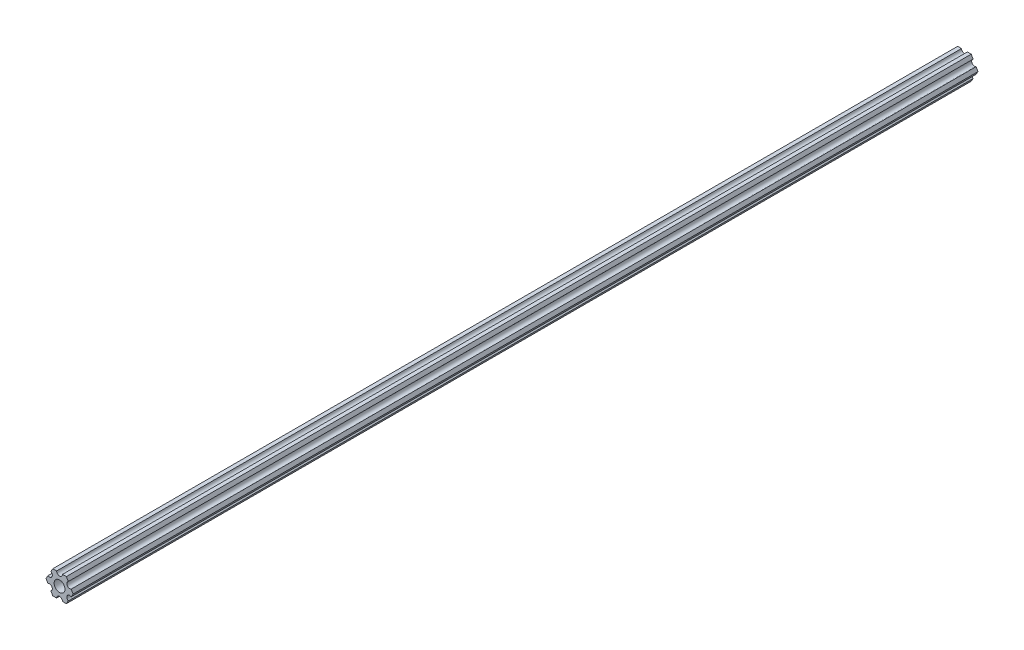
ISO-10303-21;
HEADER;
FILE_DESCRIPTION(('STEP AP214'),'2;1');
FILE_NAME('part.step','',(''),(''),'','','');
FILE_SCHEMA(('AUTOMOTIVE_DESIGN { 1 0 10303 214 1 1 1 1 }'));
ENDSEC;
DATA;
#1=APPLICATION_CONTEXT('core data for automotive mechanical design processes');
#2=APPLICATION_PROTOCOL_DEFINITION('international standard','automotive_design',2000,#1);
#3=PRODUCT_CONTEXT('',#1,'mechanical');
#4=PRODUCT('Part','Part','',(#3));
#5=PRODUCT_RELATED_PRODUCT_CATEGORY('part','',(#4));
#6=PRODUCT_DEFINITION_FORMATION('','',#4);
#7=PRODUCT_DEFINITION_CONTEXT('part definition',#1,'design');
#8=PRODUCT_DEFINITION('design','',#6,#7);
#9=PRODUCT_DEFINITION_SHAPE('','',#8);
#10=(LENGTH_UNIT() NAMED_UNIT(*) SI_UNIT(.MILLI.,.METRE.));
#11=(NAMED_UNIT(*) PLANE_ANGLE_UNIT() SI_UNIT($,.RADIAN.));
#12=(NAMED_UNIT(*) SI_UNIT($,.STERADIAN.) SOLID_ANGLE_UNIT());
#13=UNCERTAINTY_MEASURE_WITH_UNIT(LENGTH_MEASURE(1.E-05),#10,'distance_accuracy_value','');
#14=(GEOMETRIC_REPRESENTATION_CONTEXT(3) GLOBAL_UNCERTAINTY_ASSIGNED_CONTEXT((#13)) GLOBAL_UNIT_ASSIGNED_CONTEXT((#10,
#11,#12)) REPRESENTATION_CONTEXT('',''));
#15=CARTESIAN_POINT('',(0.,0.,0.));
#16=DIRECTION('',(0.,0.,1.));
#17=DIRECTION('',(1.,0.,0.));
#18=AXIS2_PLACEMENT_3D('',#15,#16,#17);
#19=CARTESIAN_POINT('',(5.49926112168156,3.17500033315933,488.95));
#20=DIRECTION('',(0.,0.,1.));
#21=DIRECTION('',(1.,0.,0.));
#22=AXIS2_PLACEMENT_3D('',#19,#20,#21);
#23=PLANE('',#22);
#24=DIRECTION('',(0.499999947533953,0.866025434075723,0.));
#25=VECTOR('',#24,1.);
#26=CARTESIAN_POINT('',(6.29301142309098,-1.80018429024546,488.95));
#27=LINE('',#26,#25);
#28=CARTESIAN_POINT('',(6.29301142309098,-1.80018429024546,488.95));
#29=VERTEX_POINT('',#28);
#30=CARTESIAN_POINT('',(7.33234841870826,4.44212519169686E-07,488.95));
#31=VERTEX_POINT('',#30);
#32=EDGE_CURVE('E227',#29,#31,#27,.T.);
#33=ORIENTED_EDGE('',*,*,#32,.T.);
#34=DIRECTION('',(-0.500000052466056,0.866025373493145,0.));
#35=VECTOR('',#34,1.);
#36=CARTESIAN_POINT('',(7.33234841870826,4.44212519169686E-07,488.95));
#37=LINE('',#36,#35);
#38=CARTESIAN_POINT('',(6.29301120497139,1.80018505273894,488.95));
#39=VERTEX_POINT('',#38);
#40=EDGE_CURVE('E125',#31,#39,#37,.T.);
#41=ORIENTED_EDGE('',*,*,#40,.T.);
#42=CARTESIAN_POINT('',(5.49926112168156,3.17500033315933,488.95));
#43=DIRECTION('',(0.,0.,-1.));
#44=DIRECTION('',(1.,0.,0.));
#45=AXIS2_PLACEMENT_3D('',#42,#43,#44);
#46=CIRCLE('',#45,1.5875);
#47=CARTESIAN_POINT('',(4.70551103839172,4.54981561357972,488.95));
#48=VERTEX_POINT('',#47);
#49=EDGE_CURVE('E272',#39,#48,#46,.T.);
#50=ORIENTED_EDGE('',*,*,#49,.T.);
#51=DIRECTION('',(-0.500000052466046,0.866025373493151,0.));
#52=VECTOR('',#51,1.);
#53=CARTESIAN_POINT('',(4.70551103839172,4.54981561357972,488.95));
#54=LINE('',#53,#52);
#55=CARTESIAN_POINT('',(3.66617382465481,6.35000022210627,488.95));
#56=VERTEX_POINT('',#55);
#57=EDGE_CURVE('E291',#48,#56,#54,.T.);
#58=ORIENTED_EDGE('',*,*,#57,.T.);
#59=DIRECTION('',(-0.999999999999998,-6.05825850611185E-08,0.));
#60=VECTOR('',#59,1.);
#61=CARTESIAN_POINT('',(3.66617382465481,6.35000022210627,488.95));
#62=LINE('',#61,#60);
#63=CARTESIAN_POINT('',(1.58749961530074,6.35000009617482,488.95));
#64=VERTEX_POINT('',#63);
#65=EDGE_CURVE('E288',#56,#64,#62,.T.);
#66=ORIENTED_EDGE('',*,*,#65,.T.);
#67=CARTESIAN_POINT('',(-3.84699260060323E-07,6.35,488.95));
#68=DIRECTION('',(0.,0.,-1.));
#69=DIRECTION('',(1.,0.,0.));
#70=AXIS2_PLACEMENT_3D('',#67,#68,#69);
#71=CIRCLE('',#70,1.5875);
#72=CARTESIAN_POINT('',(-1.58750038469926,6.34999990382518,488.95));
#73=VERTEX_POINT('',#72);
#74=EDGE_CURVE('E290',#64,#73,#71,.T.);
#75=ORIENTED_EDGE('',*,*,#74,.T.);
#76=DIRECTION('',(-0.999999999999998,-6.05825963273174E-08,0.));
#77=VECTOR('',#76,1.);
#78=CARTESIAN_POINT('',(-1.58750038469926,6.34999990382518,488.95));
#79=LINE('',#78,#77);
#80=CARTESIAN_POINT('',(-3.66617459405349,6.3499997778937,488.95));
#81=VERTEX_POINT('',#80);
#82=EDGE_CURVE('E293',#73,#81,#79,.T.);
#83=ORIENTED_EDGE('',*,*,#82,.T.);
#84=DIRECTION('',(-0.499999947533942,-0.866025434075729,0.));
#85=VECTOR('',#84,1.);
#86=CARTESIAN_POINT('',(-3.66617459405349,6.3499997778937,488.95));
#87=LINE('',#86,#85);
#88=CARTESIAN_POINT('',(-4.70551158967065,4.54981504343587,488.95));
#89=VERTEX_POINT('',#88);
#90=EDGE_CURVE('E299',#81,#89,#87,.T.);
#91=ORIENTED_EDGE('',*,*,#90,.T.);
#92=CARTESIAN_POINT('',(-5.49926150638082,3.17499966684067,488.95));
#93=DIRECTION('',(0.,0.,-1.));
#94=DIRECTION('',(1.,0.,0.));
#95=AXIS2_PLACEMENT_3D('',#92,#93,#94);
#96=CIRCLE('',#95,1.5875);
#97=CARTESIAN_POINT('',(-6.29301142309098,1.80018429024547,488.95));
#98=VERTEX_POINT('',#97);
#99=EDGE_CURVE('E301',#89,#98,#96,.T.);
#100=ORIENTED_EDGE('',*,*,#99,.T.);
#101=DIRECTION('',(-0.499999947533951,-0.866025434075724,0.));
#102=VECTOR('',#101,1.);
#103=CARTESIAN_POINT('',(-6.29301142309098,1.80018429024547,488.95));
#104=LINE('',#103,#102);
#105=CARTESIAN_POINT('',(-7.33234841870826,-4.44212523790841E-07,488.95));
#106=VERTEX_POINT('',#105);
#107=EDGE_CURVE('E303',#98,#106,#104,.T.);
#108=ORIENTED_EDGE('',*,*,#107,.T.);
#109=DIRECTION('',(0.500000052466045,-0.866025373493151,0.));
#110=VECTOR('',#109,1.);
#111=CARTESIAN_POINT('',(-7.33234841870826,-4.44212523790841E-07,488.95));
#112=LINE('',#111,#110);
#113=CARTESIAN_POINT('',(-6.29301120497141,-1.80018505273897,488.95));
#114=VERTEX_POINT('',#113);
#115=EDGE_CURVE('E305',#106,#114,#112,.T.);
#116=ORIENTED_EDGE('',*,*,#115,.T.);
#117=CARTESIAN_POINT('',(-5.49926112168156,-3.17500033315934,488.95));
#118=DIRECTION('',(0.,0.,-1.));
#119=DIRECTION('',(1.,0.,0.));
#120=AXIS2_PLACEMENT_3D('',#117,#118,#119);
#121=CIRCLE('',#120,1.5875);
#122=CARTESIAN_POINT('',(-4.70551103839172,-4.54981561357972,488.95));
#123=VERTEX_POINT('',#122);
#124=EDGE_CURVE('E307',#114,#123,#121,.T.);
#125=ORIENTED_EDGE('',*,*,#124,.T.);
#126=DIRECTION('',(0.500000052466045,-0.866025373493151,0.));
#127=VECTOR('',#126,1.);
#128=CARTESIAN_POINT('',(-4.70551103839172,-4.54981561357972,488.95));
#129=LINE('',#128,#127);
#130=CARTESIAN_POINT('',(-3.66617382465481,-6.35000022210628,488.95));
#131=VERTEX_POINT('',#130);
#132=EDGE_CURVE('E309',#123,#131,#129,.T.);
#133=ORIENTED_EDGE('',*,*,#132,.T.);
#134=DIRECTION('',(0.999999999999998,6.05825854783851E-08,0.));
#135=VECTOR('',#134,1.);
#136=CARTESIAN_POINT('',(-3.66617382465481,-6.35000022210628,488.95));
#137=LINE('',#136,#135);
#138=CARTESIAN_POINT('',(-1.58749961530074,-6.35000009617482,488.95));
#139=VERTEX_POINT('',#138);
#140=EDGE_CURVE('E311',#131,#139,#137,.T.);
#141=ORIENTED_EDGE('',*,*,#140,.T.);
#142=CARTESIAN_POINT('',(3.8469926204343E-07,-6.35,488.95));
#143=DIRECTION('',(0.,0.,-1.));
#144=DIRECTION('',(1.,0.,0.));
#145=AXIS2_PLACEMENT_3D('',#142,#143,#144);
#146=CIRCLE('',#145,1.5875);
#147=CARTESIAN_POINT('',(1.58750038469926,-6.34999990382518,488.95));
#148=VERTEX_POINT('',#147);
#149=EDGE_CURVE('E174',#139,#148,#146,.T.);
#150=ORIENTED_EDGE('',*,*,#149,.T.);
#151=DIRECTION('',(0.999999999999998,6.05825721258438E-08,0.));
#152=VECTOR('',#151,1.);
#153=CARTESIAN_POINT('',(1.58750038469926,-6.34999990382518,488.95));
#154=LINE('',#153,#152);
#155=CARTESIAN_POINT('',(3.66617459405346,-6.34999977789375,488.95));
#156=VERTEX_POINT('',#155);
#157=EDGE_CURVE('E168',#148,#156,#154,.T.);
#158=ORIENTED_EDGE('',*,*,#157,.T.);
#159=DIRECTION('',(0.499999947533941,0.86602543407573,0.));
#160=VECTOR('',#159,1.);
#161=CARTESIAN_POINT('',(3.66617459405346,-6.34999977789375,488.95));
#162=LINE('',#161,#160);
#163=CARTESIAN_POINT('',(4.70551158967065,-4.54981504343587,488.95));
#164=VERTEX_POINT('',#163);
#165=EDGE_CURVE('E172',#156,#164,#162,.T.);
#166=ORIENTED_EDGE('',*,*,#165,.T.);
#167=CARTESIAN_POINT('',(5.49926150638082,-3.17499966684067,488.95));
#168=DIRECTION('',(0.,0.,-1.));
#169=DIRECTION('',(1.,0.,0.));
#170=AXIS2_PLACEMENT_3D('',#167,#168,#169);
#171=CIRCLE('',#170,1.58750000000001);
#172=EDGE_CURVE('E52',#164,#29,#171,.T.);
#173=ORIENTED_EDGE('',*,*,#172,.T.);
#174=EDGE_LOOP('',(#33,#41,#50,#58,#66,#75,#83,#91,#100,#108,#116,#125,#133,#141,#150,#158,#166,#173));
#175=FACE_BOUND('',#174,.T.);
#176=CARTESIAN_POINT('',(0.,0.,488.95));
#177=DIRECTION('',(0.,0.,1.));
#178=DIRECTION('',(1.,0.,0.));
#179=AXIS2_PLACEMENT_3D('',#176,#177,#178);
#180=CIRCLE('',#179,2.9337);
#181=CARTESIAN_POINT('',(2.9337,0.,488.95));
#182=VERTEX_POINT('',#181);
#183=EDGE_CURVE('E196',#182,#182,#180,.T.);
#184=ORIENTED_EDGE('',*,*,#183,.F.);
#185=EDGE_LOOP('',(#184));
#186=FACE_BOUND('',#185,.T.);
#187=ADVANCED_FACE('F35',(#175,#186),#23,.T.);
#188=CARTESIAN_POINT('',(5.49926112168156,3.17500033315933,0.));
#189=DIRECTION('',(0.,0.,1.));
#190=DIRECTION('',(1.,0.,0.));
#191=AXIS2_PLACEMENT_3D('',#188,#189,#190);
#192=PLANE('',#191);
#193=DIRECTION('',(0.499999947533953,0.866025434075723,0.));
#194=VECTOR('',#193,1.);
#195=CARTESIAN_POINT('',(6.29301142309098,-1.80018429024546,0.));
#196=LINE('',#195,#194);
#197=CARTESIAN_POINT('',(6.29301142309098,-1.80018429024546,0.));
#198=VERTEX_POINT('',#197);
#199=CARTESIAN_POINT('',(7.33234841870826,4.44212519169686E-07,0.));
#200=VERTEX_POINT('',#199);
#201=EDGE_CURVE('E192',#198,#200,#196,.T.);
#202=ORIENTED_EDGE('',*,*,#201,.F.);
#203=CARTESIAN_POINT('',(5.49926150638082,-3.17499966684067,0.));
#204=DIRECTION('',(0.,0.,-1.));
#205=DIRECTION('',(1.,0.,0.));
#206=AXIS2_PLACEMENT_3D('',#203,#204,#205);
#207=CIRCLE('',#206,1.58750000000001);
#208=CARTESIAN_POINT('',(4.70551158967065,-4.54981504343587,0.));
#209=VERTEX_POINT('',#208);
#210=EDGE_CURVE('E117',#209,#198,#207,.T.);
#211=ORIENTED_EDGE('',*,*,#210,.F.);
#212=DIRECTION('',(0.499999947533941,0.86602543407573,0.));
#213=VECTOR('',#212,1.);
#214=CARTESIAN_POINT('',(3.66617459405346,-6.34999977789375,0.));
#215=LINE('',#214,#213);
#216=CARTESIAN_POINT('',(3.66617459405346,-6.34999977789375,0.));
#217=VERTEX_POINT('',#216);
#218=EDGE_CURVE('E111',#217,#209,#215,.T.);
#219=ORIENTED_EDGE('',*,*,#218,.F.);
#220=DIRECTION('',(0.999999999999998,6.05825721258438E-08,0.));
#221=VECTOR('',#220,1.);
#222=CARTESIAN_POINT('',(1.58750038469926,-6.34999990382518,0.));
#223=LINE('',#222,#221);
#224=CARTESIAN_POINT('',(1.58750038469926,-6.34999990382518,0.));
#225=VERTEX_POINT('',#224);
#226=EDGE_CURVE('E182',#225,#217,#223,.T.);
#227=ORIENTED_EDGE('',*,*,#226,.F.);
#228=CARTESIAN_POINT('',(3.8469926204343E-07,-6.35,0.));
#229=DIRECTION('',(0.,0.,-1.));
#230=DIRECTION('',(1.,0.,0.));
#231=AXIS2_PLACEMENT_3D('',#228,#229,#230);
#232=CIRCLE('',#231,1.5875);
#233=CARTESIAN_POINT('',(-1.58749961530074,-6.35000009617482,0.));
#234=VERTEX_POINT('',#233);
#235=EDGE_CURVE('E222',#234,#225,#232,.T.);
#236=ORIENTED_EDGE('',*,*,#235,.F.);
#237=DIRECTION('',(0.999999999999998,6.05825854783851E-08,0.));
#238=VECTOR('',#237,1.);
#239=CARTESIAN_POINT('',(-3.66617382465481,-6.35000022210628,0.));
#240=LINE('',#239,#238);
#241=CARTESIAN_POINT('',(-3.66617382465481,-6.35000022210628,0.));
#242=VERTEX_POINT('',#241);
#243=EDGE_CURVE('E220',#242,#234,#240,.T.);
#244=ORIENTED_EDGE('',*,*,#243,.F.);
#245=DIRECTION('',(0.500000052466045,-0.866025373493151,0.));
#246=VECTOR('',#245,1.);
#247=CARTESIAN_POINT('',(-4.70551103839172,-4.54981561357972,0.));
#248=LINE('',#247,#246);
#249=CARTESIAN_POINT('',(-4.70551103839172,-4.54981561357972,0.));
#250=VERTEX_POINT('',#249);
#251=EDGE_CURVE('E218',#250,#242,#248,.T.);
#252=ORIENTED_EDGE('',*,*,#251,.F.);
#253=CARTESIAN_POINT('',(-5.49926112168156,-3.17500033315934,0.));
#254=DIRECTION('',(0.,0.,-1.));
#255=DIRECTION('',(1.,0.,0.));
#256=AXIS2_PLACEMENT_3D('',#253,#254,#255);
#257=CIRCLE('',#256,1.5875);
#258=CARTESIAN_POINT('',(-6.29301120497141,-1.80018505273897,0.));
#259=VERTEX_POINT('',#258);
#260=EDGE_CURVE('E216',#259,#250,#257,.T.);
#261=ORIENTED_EDGE('',*,*,#260,.F.);
#262=DIRECTION('',(0.500000052466045,-0.866025373493151,0.));
#263=VECTOR('',#262,1.);
#264=CARTESIAN_POINT('',(-7.33234841870826,-4.44212523790841E-07,0.));
#265=LINE('',#264,#263);
#266=CARTESIAN_POINT('',(-7.33234841870826,-4.44212523790841E-07,0.));
#267=VERTEX_POINT('',#266);
#268=EDGE_CURVE('E214',#267,#259,#265,.T.);
#269=ORIENTED_EDGE('',*,*,#268,.F.);
#270=DIRECTION('',(-0.499999947533951,-0.866025434075724,0.));
#271=VECTOR('',#270,1.);
#272=CARTESIAN_POINT('',(-6.29301142309098,1.80018429024547,0.));
#273=LINE('',#272,#271);
#274=CARTESIAN_POINT('',(-6.29301142309098,1.80018429024547,0.));
#275=VERTEX_POINT('',#274);
#276=EDGE_CURVE('E212',#275,#267,#273,.T.);
#277=ORIENTED_EDGE('',*,*,#276,.F.);
#278=CARTESIAN_POINT('',(-5.49926150638082,3.17499966684067,0.));
#279=DIRECTION('',(0.,0.,-1.));
#280=DIRECTION('',(1.,0.,0.));
#281=AXIS2_PLACEMENT_3D('',#278,#279,#280);
#282=CIRCLE('',#281,1.5875);
#283=CARTESIAN_POINT('',(-4.70551158967065,4.54981504343587,0.));
#284=VERTEX_POINT('',#283);
#285=EDGE_CURVE('E210',#284,#275,#282,.T.);
#286=ORIENTED_EDGE('',*,*,#285,.F.);
#287=DIRECTION('',(-0.499999947533942,-0.866025434075729,0.));
#288=VECTOR('',#287,1.);
#289=CARTESIAN_POINT('',(-3.66617459405349,6.3499997778937,0.));
#290=LINE('',#289,#288);
#291=CARTESIAN_POINT('',(-3.66617459405349,6.3499997778937,0.));
#292=VERTEX_POINT('',#291);
#293=EDGE_CURVE('E208',#292,#284,#290,.T.);
#294=ORIENTED_EDGE('',*,*,#293,.F.);
#295=DIRECTION('',(-0.999999999999998,-6.05825963273174E-08,0.));
#296=VECTOR('',#295,1.);
#297=CARTESIAN_POINT('',(-1.58750038469926,6.34999990382518,0.));
#298=LINE('',#297,#296);
#299=CARTESIAN_POINT('',(-1.58750038469926,6.34999990382518,0.));
#300=VERTEX_POINT('',#299);
#301=EDGE_CURVE('E206',#300,#292,#298,.T.);
#302=ORIENTED_EDGE('',*,*,#301,.F.);
#303=CARTESIAN_POINT('',(-3.84699260060323E-07,6.35,0.));
#304=DIRECTION('',(0.,0.,-1.));
#305=DIRECTION('',(1.,0.,0.));
#306=AXIS2_PLACEMENT_3D('',#303,#304,#305);
#307=CIRCLE('',#306,1.5875);
#308=CARTESIAN_POINT('',(1.58749961530074,6.35000009617482,0.));
#309=VERTEX_POINT('',#308);
#310=EDGE_CURVE('E204',#309,#300,#307,.T.);
#311=ORIENTED_EDGE('',*,*,#310,.F.);
#312=DIRECTION('',(-0.999999999999998,-6.05825850611185E-08,0.));
#313=VECTOR('',#312,1.);
#314=CARTESIAN_POINT('',(3.66617382465481,6.35000022210627,0.));
#315=LINE('',#314,#313);
#316=CARTESIAN_POINT('',(3.66617382465481,6.35000022210627,0.));
#317=VERTEX_POINT('',#316);
#318=EDGE_CURVE('E202',#317,#309,#315,.T.);
#319=ORIENTED_EDGE('',*,*,#318,.F.);
#320=DIRECTION('',(-0.500000052466046,0.866025373493151,0.));
#321=VECTOR('',#320,1.);
#322=CARTESIAN_POINT('',(4.70551103839172,4.54981561357972,0.));
#323=LINE('',#322,#321);
#324=CARTESIAN_POINT('',(4.70551103839172,4.54981561357972,0.));
#325=VERTEX_POINT('',#324);
#326=EDGE_CURVE('E200',#325,#317,#323,.T.);
#327=ORIENTED_EDGE('',*,*,#326,.F.);
#328=CARTESIAN_POINT('',(5.49926112168156,3.17500033315933,0.));
#329=DIRECTION('',(0.,0.,-1.));
#330=DIRECTION('',(1.,0.,0.));
#331=AXIS2_PLACEMENT_3D('',#328,#329,#330);
#332=CIRCLE('',#331,1.5875);
#333=CARTESIAN_POINT('',(6.29301120497139,1.80018505273894,0.));
#334=VERTEX_POINT('',#333);
#335=EDGE_CURVE('E198',#334,#325,#332,.T.);
#336=ORIENTED_EDGE('',*,*,#335,.F.);
#337=DIRECTION('',(-0.500000052466056,0.866025373493145,0.));
#338=VECTOR('',#337,1.);
#339=CARTESIAN_POINT('',(7.33234841870826,4.44212519169686E-07,0.));
#340=LINE('',#339,#338);
#341=EDGE_CURVE('E195',#200,#334,#340,.T.);
#342=ORIENTED_EDGE('',*,*,#341,.F.);
#343=EDGE_LOOP('',(#202,#211,#219,#227,#236,#244,#252,#261,#269,#277,#286,#294,#302,#311,#319,
#327,#336,#342));
#344=FACE_BOUND('',#343,.T.);
#345=CARTESIAN_POINT('',(0.,0.,0.));
#346=DIRECTION('',(0.,0.,1.));
#347=DIRECTION('',(1.,0.,0.));
#348=AXIS2_PLACEMENT_3D('',#345,#346,#347);
#349=CIRCLE('',#348,2.9337);
#350=CARTESIAN_POINT('',(2.9337,0.,0.));
#351=VERTEX_POINT('',#350);
#352=EDGE_CURVE('E536',#351,#351,#349,.T.);
#353=ORIENTED_EDGE('',*,*,#352,.T.);
#354=EDGE_LOOP('',(#353));
#355=FACE_BOUND('',#354,.T.);
#356=ADVANCED_FACE('F276',(#344,#355),#192,.F.);
#357=CARTESIAN_POINT('',(6.29301142309098,-1.80018429024546,488.95));
#358=DIRECTION('',(-0.866025434075723,0.499999947533953,0.));
#359=DIRECTION('',(-0.499999947533953,-0.866025434075723,0.));
#360=AXIS2_PLACEMENT_3D('',#357,#358,#359);
#361=PLANE('',#360);
#362=ORIENTED_EDGE('',*,*,#201,.T.);
#363=DIRECTION('',(0.,0.,-1.));
#364=VECTOR('',#363,1.);
#365=CARTESIAN_POINT('',(7.33234841870826,4.44212519169686E-07,488.95));
#366=LINE('',#365,#364);
#367=EDGE_CURVE('E11',#31,#200,#366,.T.);
#368=ORIENTED_EDGE('',*,*,#367,.F.);
#369=ORIENTED_EDGE('',*,*,#32,.F.);
#370=DIRECTION('',(0.,0.,-1.));
#371=VECTOR('',#370,1.);
#372=CARTESIAN_POINT('',(6.29301142309098,-1.80018429024546,488.95));
#373=LINE('',#372,#371);
#374=EDGE_CURVE('E188',#29,#198,#373,.T.);
#375=ORIENTED_EDGE('',*,*,#374,.T.);
#376=EDGE_LOOP('',(#362,#368,#369,#375));
#377=FACE_BOUND('',#376,.T.);
#378=ADVANCED_FACE('F37',(#377),#361,.F.);
#379=CARTESIAN_POINT('',(7.33234841870826,4.44212519169686E-07,488.95));
#380=DIRECTION('',(-0.866025373493145,-0.500000052466057,0.));
#381=DIRECTION('',(0.500000052466056,-0.866025373493145,0.));
#382=AXIS2_PLACEMENT_3D('',#379,#380,#381);
#383=PLANE('',#382);
#384=ORIENTED_EDGE('',*,*,#341,.T.);
#385=DIRECTION('',(0.,0.,-1.));
#386=VECTOR('',#385,1.);
#387=CARTESIAN_POINT('',(6.29301120497139,1.80018505273894,488.95));
#388=LINE('',#387,#386);
#389=EDGE_CURVE('E44',#39,#334,#388,.T.);
#390=ORIENTED_EDGE('',*,*,#389,.F.);
#391=ORIENTED_EDGE('',*,*,#40,.F.);
#392=ORIENTED_EDGE('',*,*,#367,.T.);
#393=EDGE_LOOP('',(#384,#390,#391,#392));
#394=FACE_BOUND('',#393,.T.);
#395=ADVANCED_FACE('F345',(#394),#383,.F.);
#396=CARTESIAN_POINT('',(5.49926112168156,3.17500033315933,488.95));
#397=DIRECTION('',(0.,0.,-1.));
#398=DIRECTION('',(-1.,0.,0.));
#399=AXIS2_PLACEMENT_3D('',#396,#397,#398);
#400=CYLINDRICAL_SURFACE('',#399,1.5875);
#401=ORIENTED_EDGE('',*,*,#335,.T.);
#402=DIRECTION('',(0.,0.,-1.));
#403=VECTOR('',#402,1.);
#404=CARTESIAN_POINT('',(4.70551103839172,4.54981561357972,488.95));
#405=LINE('',#404,#403);
#406=EDGE_CURVE('E264',#48,#325,#405,.T.);
#407=ORIENTED_EDGE('',*,*,#406,.F.);
#408=ORIENTED_EDGE('',*,*,#49,.F.);
#409=ORIENTED_EDGE('',*,*,#389,.T.);
#410=EDGE_LOOP('',(#401,#407,#408,#409));
#411=FACE_BOUND('',#410,.T.);
#412=ADVANCED_FACE('F270',(#411),#400,.F.);
#413=CARTESIAN_POINT('',(4.70551103839172,4.54981561357972,488.95));
#414=DIRECTION('',(-0.866025373493151,-0.500000052466046,0.));
#415=DIRECTION('',(0.500000052466046,-0.866025373493151,0.));
#416=AXIS2_PLACEMENT_3D('',#413,#414,#415);
#417=PLANE('',#416);
#418=ORIENTED_EDGE('',*,*,#326,.T.);
#419=DIRECTION('',(0.,0.,-1.));
#420=VECTOR('',#419,1.);
#421=CARTESIAN_POINT('',(3.66617382465481,6.35000022210627,488.95));
#422=LINE('',#421,#420);
#423=EDGE_CURVE('E261',#56,#317,#422,.T.);
#424=ORIENTED_EDGE('',*,*,#423,.F.);
#425=ORIENTED_EDGE('',*,*,#57,.F.);
#426=ORIENTED_EDGE('',*,*,#406,.T.);
#427=EDGE_LOOP('',(#418,#424,#425,#426));
#428=FACE_BOUND('',#427,.T.);
#429=ADVANCED_FACE('F282',(#428),#417,.F.);
#430=CARTESIAN_POINT('',(3.66617382465481,6.35000022210627,488.95));
#431=DIRECTION('',(6.05825850611185E-08,-0.999999999999998,0.));
#432=DIRECTION('',(0.999999999999998,6.05825850611185E-08,0.));
#433=AXIS2_PLACEMENT_3D('',#430,#431,#432);
#434=PLANE('',#433);
#435=ORIENTED_EDGE('',*,*,#318,.T.);
#436=DIRECTION('',(0.,0.,-1.));
#437=VECTOR('',#436,1.);
#438=CARTESIAN_POINT('',(1.58749961530074,6.35000009617482,488.95));
#439=LINE('',#438,#437);
#440=EDGE_CURVE('E258',#64,#309,#439,.T.);
#441=ORIENTED_EDGE('',*,*,#440,.F.);
#442=ORIENTED_EDGE('',*,*,#65,.F.);
#443=ORIENTED_EDGE('',*,*,#423,.T.);
#444=EDGE_LOOP('',(#435,#441,#442,#443));
#445=FACE_BOUND('',#444,.T.);
#446=ADVANCED_FACE('F286',(#445),#434,.F.);
#447=CARTESIAN_POINT('',(-3.84699260060323E-07,6.35,488.95));
#448=DIRECTION('',(0.,0.,-1.));
#449=DIRECTION('',(-1.,0.,0.));
#450=AXIS2_PLACEMENT_3D('',#447,#448,#449);
#451=CYLINDRICAL_SURFACE('',#450,1.5875);
#452=ORIENTED_EDGE('',*,*,#310,.T.);
#453=DIRECTION('',(0.,0.,-1.));
#454=VECTOR('',#453,1.);
#455=CARTESIAN_POINT('',(-1.58750038469926,6.34999990382518,488.95));
#456=LINE('',#455,#454);
#457=EDGE_CURVE('E255',#73,#300,#456,.T.);
#458=ORIENTED_EDGE('',*,*,#457,.F.);
#459=ORIENTED_EDGE('',*,*,#74,.F.);
#460=ORIENTED_EDGE('',*,*,#440,.T.);
#461=EDGE_LOOP('',(#452,#458,#459,#460));
#462=FACE_BOUND('',#461,.T.);
#463=ADVANCED_FACE('F358',(#462),#451,.F.);
#464=CARTESIAN_POINT('',(-1.58750038469926,6.34999990382518,488.95));
#465=DIRECTION('',(6.05825963273174E-08,-0.999999999999998,0.));
#466=DIRECTION('',(0.999999999999998,6.05825963273174E-08,0.));
#467=AXIS2_PLACEMENT_3D('',#464,#465,#466);
#468=PLANE('',#467);
#469=ORIENTED_EDGE('',*,*,#301,.T.);
#470=DIRECTION('',(0.,0.,-1.));
#471=VECTOR('',#470,1.);
#472=CARTESIAN_POINT('',(-3.66617459405349,6.3499997778937,488.95));
#473=LINE('',#472,#471);
#474=EDGE_CURVE('E252',#81,#292,#473,.T.);
#475=ORIENTED_EDGE('',*,*,#474,.F.);
#476=ORIENTED_EDGE('',*,*,#82,.F.);
#477=ORIENTED_EDGE('',*,*,#457,.T.);
#478=EDGE_LOOP('',(#469,#475,#476,#477));
#479=FACE_BOUND('',#478,.T.);
#480=ADVANCED_FACE('F361',(#479),#468,.F.);
#481=CARTESIAN_POINT('',(-3.66617459405349,6.3499997778937,488.95));
#482=DIRECTION('',(0.866025434075729,-0.499999947533942,0.));
#483=DIRECTION('',(0.499999947533943,0.866025434075729,0.));
#484=AXIS2_PLACEMENT_3D('',#481,#482,#483);
#485=PLANE('',#484);
#486=ORIENTED_EDGE('',*,*,#293,.T.);
#487=DIRECTION('',(0.,0.,-1.));
#488=VECTOR('',#487,1.);
#489=CARTESIAN_POINT('',(-4.70551158967065,4.54981504343587,488.95));
#490=LINE('',#489,#488);
#491=EDGE_CURVE('E249',#89,#284,#490,.T.);
#492=ORIENTED_EDGE('',*,*,#491,.F.);
#493=ORIENTED_EDGE('',*,*,#90,.F.);
#494=ORIENTED_EDGE('',*,*,#474,.T.);
#495=EDGE_LOOP('',(#486,#492,#493,#494));
#496=FACE_BOUND('',#495,.T.);
#497=ADVANCED_FACE('F365',(#496),#485,.F.);
#498=CARTESIAN_POINT('',(-5.49926150638082,3.17499966684067,488.95));
#499=DIRECTION('',(0.,0.,-1.));
#500=DIRECTION('',(-1.,0.,0.));
#501=AXIS2_PLACEMENT_3D('',#498,#499,#500);
#502=CYLINDRICAL_SURFACE('',#501,1.5875);
#503=ORIENTED_EDGE('',*,*,#285,.T.);
#504=DIRECTION('',(0.,0.,-1.));
#505=VECTOR('',#504,1.);
#506=CARTESIAN_POINT('',(-6.29301142309098,1.80018429024547,488.95));
#507=LINE('',#506,#505);
#508=EDGE_CURVE('E246',#98,#275,#507,.T.);
#509=ORIENTED_EDGE('',*,*,#508,.F.);
#510=ORIENTED_EDGE('',*,*,#99,.F.);
#511=ORIENTED_EDGE('',*,*,#491,.T.);
#512=EDGE_LOOP('',(#503,#509,#510,#511));
#513=FACE_BOUND('',#512,.T.);
#514=ADVANCED_FACE('F369',(#513),#502,.F.);
#515=CARTESIAN_POINT('',(-6.29301142309098,1.80018429024547,488.95));
#516=DIRECTION('',(0.866025434075724,-0.499999947533952,0.));
#517=DIRECTION('',(0.499999947533952,0.866025434075724,0.));
#518=AXIS2_PLACEMENT_3D('',#515,#516,#517);
#519=PLANE('',#518);
#520=ORIENTED_EDGE('',*,*,#276,.T.);
#521=DIRECTION('',(0.,0.,-1.));
#522=VECTOR('',#521,1.);
#523=CARTESIAN_POINT('',(-7.33234841870826,-4.44212523790841E-07,488.95));
#524=LINE('',#523,#522);
#525=EDGE_CURVE('E243',#106,#267,#524,.T.);
#526=ORIENTED_EDGE('',*,*,#525,.F.);
#527=ORIENTED_EDGE('',*,*,#107,.F.);
#528=ORIENTED_EDGE('',*,*,#508,.T.);
#529=EDGE_LOOP('',(#520,#526,#527,#528));
#530=FACE_BOUND('',#529,.T.);
#531=ADVANCED_FACE('F373',(#530),#519,.F.);
#532=CARTESIAN_POINT('',(-7.33234841870826,-4.44212523790841E-07,488.95));
#533=DIRECTION('',(0.866025373493151,0.500000052466045,0.));
#534=DIRECTION('',(-0.500000052466045,0.866025373493151,0.));
#535=AXIS2_PLACEMENT_3D('',#532,#533,#534);
#536=PLANE('',#535);
#537=ORIENTED_EDGE('',*,*,#268,.T.);
#538=DIRECTION('',(0.,0.,-1.));
#539=VECTOR('',#538,1.);
#540=CARTESIAN_POINT('',(-6.29301120497141,-1.80018505273897,488.95));
#541=LINE('',#540,#539);
#542=EDGE_CURVE('E240',#114,#259,#541,.T.);
#543=ORIENTED_EDGE('',*,*,#542,.F.);
#544=ORIENTED_EDGE('',*,*,#115,.F.);
#545=ORIENTED_EDGE('',*,*,#525,.T.);
#546=EDGE_LOOP('',(#537,#543,#544,#545));
#547=FACE_BOUND('',#546,.T.);
#548=ADVANCED_FACE('F377',(#547),#536,.F.);
#549=CARTESIAN_POINT('',(-5.49926112168156,-3.17500033315934,488.95));
#550=DIRECTION('',(0.,0.,-1.));
#551=DIRECTION('',(-1.,0.,0.));
#552=AXIS2_PLACEMENT_3D('',#549,#550,#551);
#553=CYLINDRICAL_SURFACE('',#552,1.5875);
#554=ORIENTED_EDGE('',*,*,#260,.T.);
#555=DIRECTION('',(0.,0.,-1.));
#556=VECTOR('',#555,1.);
#557=CARTESIAN_POINT('',(-4.70551103839172,-4.54981561357972,488.95));
#558=LINE('',#557,#556);
#559=EDGE_CURVE('E237',#123,#250,#558,.T.);
#560=ORIENTED_EDGE('',*,*,#559,.F.);
#561=ORIENTED_EDGE('',*,*,#124,.F.);
#562=ORIENTED_EDGE('',*,*,#542,.T.);
#563=EDGE_LOOP('',(#554,#560,#561,#562));
#564=FACE_BOUND('',#563,.T.);
#565=ADVANCED_FACE('F381',(#564),#553,.F.);
#566=CARTESIAN_POINT('',(-4.70551103839172,-4.54981561357972,488.95));
#567=DIRECTION('',(0.866025373493151,0.500000052466045,0.));
#568=DIRECTION('',(-0.500000052466045,0.866025373493151,0.));
#569=AXIS2_PLACEMENT_3D('',#566,#567,#568);
#570=PLANE('',#569);
#571=ORIENTED_EDGE('',*,*,#251,.T.);
#572=DIRECTION('',(0.,0.,-1.));
#573=VECTOR('',#572,1.);
#574=CARTESIAN_POINT('',(-3.66617382465481,-6.35000022210628,488.95));
#575=LINE('',#574,#573);
#576=EDGE_CURVE('E234',#131,#242,#575,.T.);
#577=ORIENTED_EDGE('',*,*,#576,.F.);
#578=ORIENTED_EDGE('',*,*,#132,.F.);
#579=ORIENTED_EDGE('',*,*,#559,.T.);
#580=EDGE_LOOP('',(#571,#577,#578,#579));
#581=FACE_BOUND('',#580,.T.);
#582=ADVANCED_FACE('F385',(#581),#570,.F.);
#583=CARTESIAN_POINT('',(-3.66617382465481,-6.35000022210628,488.95));
#584=DIRECTION('',(-6.05825854783851E-08,0.999999999999998,0.));
#585=DIRECTION('',(-0.999999999999998,-6.05825854783851E-08,0.));
#586=AXIS2_PLACEMENT_3D('',#583,#584,#585);
#587=PLANE('',#586);
#588=ORIENTED_EDGE('',*,*,#243,.T.);
#589=DIRECTION('',(0.,0.,-1.));
#590=VECTOR('',#589,1.);
#591=CARTESIAN_POINT('',(-1.58749961530074,-6.35000009617482,488.95));
#592=LINE('',#591,#590);
#593=EDGE_CURVE('E231',#139,#234,#592,.T.);
#594=ORIENTED_EDGE('',*,*,#593,.F.);
#595=ORIENTED_EDGE('',*,*,#140,.F.);
#596=ORIENTED_EDGE('',*,*,#576,.T.);
#597=EDGE_LOOP('',(#588,#594,#595,#596));
#598=FACE_BOUND('',#597,.T.);
#599=ADVANCED_FACE('F317',(#598),#587,.F.);
#600=CARTESIAN_POINT('',(3.8469926204343E-07,-6.35,488.95));
#601=DIRECTION('',(0.,0.,-1.));
#602=DIRECTION('',(-1.,0.,0.));
#603=AXIS2_PLACEMENT_3D('',#600,#601,#602);
#604=CYLINDRICAL_SURFACE('',#603,1.5875);
#605=ORIENTED_EDGE('',*,*,#235,.T.);
#606=DIRECTION('',(0.,0.,-1.));
#607=VECTOR('',#606,1.);
#608=CARTESIAN_POINT('',(1.58750038469926,-6.34999990382518,488.95));
#609=LINE('',#608,#607);
#610=EDGE_CURVE('E183',#148,#225,#609,.T.);
#611=ORIENTED_EDGE('',*,*,#610,.F.);
#612=ORIENTED_EDGE('',*,*,#149,.F.);
#613=ORIENTED_EDGE('',*,*,#593,.T.);
#614=EDGE_LOOP('',(#605,#611,#612,#613));
#615=FACE_BOUND('',#614,.T.);
#616=ADVANCED_FACE('F321',(#615),#604,.F.);
#617=CARTESIAN_POINT('',(1.58750038469926,-6.34999990382518,488.95));
#618=DIRECTION('',(-6.05825721258438E-08,0.999999999999998,0.));
#619=DIRECTION('',(-0.999999999999998,-6.05825721258438E-08,0.));
#620=AXIS2_PLACEMENT_3D('',#617,#618,#619);
#621=PLANE('',#620);
#622=ORIENTED_EDGE('',*,*,#226,.T.);
#623=DIRECTION('',(0.,0.,-1.));
#624=VECTOR('',#623,1.);
#625=CARTESIAN_POINT('',(3.66617459405346,-6.34999977789375,488.95));
#626=LINE('',#625,#624);
#627=EDGE_CURVE('E179',#156,#217,#626,.T.);
#628=ORIENTED_EDGE('',*,*,#627,.F.);
#629=ORIENTED_EDGE('',*,*,#157,.F.);
#630=ORIENTED_EDGE('',*,*,#610,.T.);
#631=EDGE_LOOP('',(#622,#628,#629,#630));
#632=FACE_BOUND('',#631,.T.);
#633=ADVANCED_FACE('F180',(#632),#621,.F.);
#634=CARTESIAN_POINT('',(3.66617459405346,-6.34999977789375,488.95));
#635=DIRECTION('',(-0.86602543407573,0.499999947533941,0.));
#636=DIRECTION('',(-0.499999947533941,-0.86602543407573,0.));
#637=AXIS2_PLACEMENT_3D('',#634,#635,#636);
#638=PLANE('',#637);
#639=ORIENTED_EDGE('',*,*,#218,.T.);
#640=DIRECTION('',(0.,0.,-1.));
#641=VECTOR('',#640,1.);
#642=CARTESIAN_POINT('',(4.70551158967065,-4.54981504343587,488.95));
#643=LINE('',#642,#641);
#644=EDGE_CURVE('E184',#164,#209,#643,.T.);
#645=ORIENTED_EDGE('',*,*,#644,.F.);
#646=ORIENTED_EDGE('',*,*,#165,.F.);
#647=ORIENTED_EDGE('',*,*,#627,.T.);
#648=EDGE_LOOP('',(#639,#645,#646,#647));
#649=FACE_BOUND('',#648,.T.);
#650=ADVANCED_FACE('F186',(#649),#638,.F.);
#651=CARTESIAN_POINT('',(5.49926150638082,-3.17499966684067,488.95));
#652=DIRECTION('',(0.,0.,-1.));
#653=DIRECTION('',(-1.,0.,0.));
#654=AXIS2_PLACEMENT_3D('',#651,#652,#653);
#655=CYLINDRICAL_SURFACE('',#654,1.58750000000001);
#656=ORIENTED_EDGE('',*,*,#210,.T.);
#657=ORIENTED_EDGE('',*,*,#374,.F.);
#658=ORIENTED_EDGE('',*,*,#172,.F.);
#659=ORIENTED_EDGE('',*,*,#644,.T.);
#660=EDGE_LOOP('',(#656,#657,#658,#659));
#661=FACE_BOUND('',#660,.T.);
#662=ADVANCED_FACE('F325',(#661),#655,.F.);
#663=CARTESIAN_POINT('',(0.,0.,488.95));
#664=DIRECTION('',(0.,0.,-1.));
#665=DIRECTION('',(-1.,0.,0.));
#666=AXIS2_PLACEMENT_3D('',#663,#664,#665);
#667=CYLINDRICAL_SURFACE('',#666,2.9337);
#668=ORIENTED_EDGE('',*,*,#183,.T.);
#669=EDGE_LOOP('',(#668));
#670=FACE_BOUND('',#669,.T.);
#671=ORIENTED_EDGE('',*,*,#352,.F.);
#672=EDGE_LOOP('',(#671));
#673=FACE_BOUND('',#672,.T.);
#674=ADVANCED_FACE('F327',(#670,#673),#667,.F.);
#675=CLOSED_SHELL('',(#187,#356,#378,#395,#412,#429,#446,#463,#480,#497,#514,#531,#548,#565,
#582,#599,#616,#633,#650,#662,#674));
#676=MANIFOLD_SOLID_BREP('B2',#675);
#677=ADVANCED_BREP_SHAPE_REPRESENTATION('',(#18,#676),#14);
#678=SHAPE_DEFINITION_REPRESENTATION(#9,#677);
ENDSEC;
END-ISO-10303-21;
